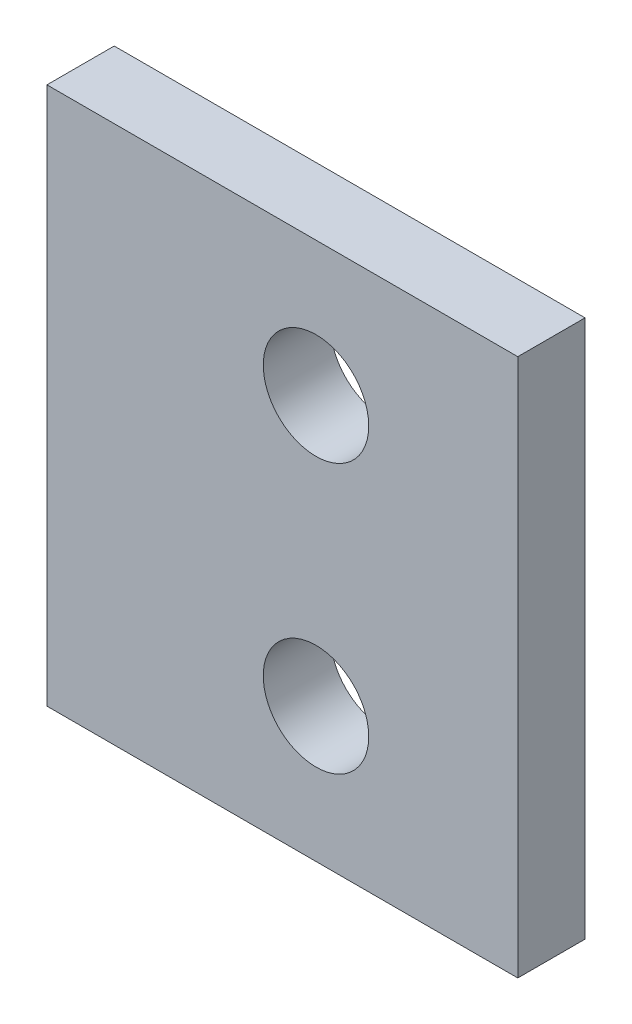
ISO-10303-21;
HEADER;
FILE_DESCRIPTION(('STEP AP214'),'2;1');
FILE_NAME('part.step','',(''),(''),'','','');
FILE_SCHEMA(('AUTOMOTIVE_DESIGN { 1 0 10303 214 1 1 1 1 }'));
ENDSEC;
DATA;
#1=APPLICATION_CONTEXT('core data for automotive mechanical design processes');
#2=APPLICATION_PROTOCOL_DEFINITION('international standard','automotive_design',2000,#1);
#3=PRODUCT_CONTEXT('',#1,'mechanical');
#4=PRODUCT('Part','Part','',(#3));
#5=PRODUCT_RELATED_PRODUCT_CATEGORY('part','',(#4));
#6=PRODUCT_DEFINITION_FORMATION('','',#4);
#7=PRODUCT_DEFINITION_CONTEXT('part definition',#1,'design');
#8=PRODUCT_DEFINITION('design','',#6,#7);
#9=PRODUCT_DEFINITION_SHAPE('','',#8);
#10=(LENGTH_UNIT() NAMED_UNIT(*) SI_UNIT(.MILLI.,.METRE.));
#11=(NAMED_UNIT(*) PLANE_ANGLE_UNIT() SI_UNIT($,.RADIAN.));
#12=(NAMED_UNIT(*) SI_UNIT($,.STERADIAN.) SOLID_ANGLE_UNIT());
#13=UNCERTAINTY_MEASURE_WITH_UNIT(LENGTH_MEASURE(1.E-05),#10,'distance_accuracy_value','');
#14=(GEOMETRIC_REPRESENTATION_CONTEXT(3) GLOBAL_UNCERTAINTY_ASSIGNED_CONTEXT((#13)) GLOBAL_UNIT_ASSIGNED_CONTEXT((#10,
#11,#12)) REPRESENTATION_CONTEXT('',''));
#15=CARTESIAN_POINT('',(0.,0.,0.));
#16=DIRECTION('',(0.,0.,1.));
#17=DIRECTION('',(1.,0.,0.));
#18=AXIS2_PLACEMENT_3D('',#15,#16,#17);
#19=CARTESIAN_POINT('',(0.,0.,3.175));
#20=DIRECTION('',(0.,0.,-1.));
#21=DIRECTION('',(-1.,0.,0.));
#22=AXIS2_PLACEMENT_3D('',#19,#20,#21);
#23=PLANE('',#22);
#24=DIRECTION('',(0.,1.,0.));
#25=VECTOR('',#24,1.);
#26=CARTESIAN_POINT('',(-3.175,101.6,3.175));
#27=LINE('',#26,#25);
#28=CARTESIAN_POINT('',(-3.175,76.2,3.175));
#29=VERTEX_POINT('',#28);
#30=CARTESIAN_POINT('',(-3.175,101.6,3.175));
#31=VERTEX_POINT('',#30);
#32=EDGE_CURVE('E86',#29,#31,#27,.T.);
#33=ORIENTED_EDGE('',*,*,#32,.T.);
#34=DIRECTION('',(-1.,0.,0.));
#35=VECTOR('',#34,1.);
#36=CARTESIAN_POINT('',(-3.175,101.6,3.175));
#37=LINE('',#36,#35);
#38=CARTESIAN_POINT('',(-25.4,101.6,3.175));
#39=VERTEX_POINT('',#38);
#40=EDGE_CURVE('E81',#31,#39,#37,.T.);
#41=ORIENTED_EDGE('',*,*,#40,.T.);
#42=DIRECTION('',(0.,-1.,0.));
#43=VECTOR('',#42,1.);
#44=CARTESIAN_POINT('',(-25.4,101.6,3.175));
#45=LINE('',#44,#43);
#46=CARTESIAN_POINT('',(-25.4,76.2,3.175));
#47=VERTEX_POINT('',#46);
#48=EDGE_CURVE('E84',#39,#47,#45,.T.);
#49=ORIENTED_EDGE('',*,*,#48,.T.);
#50=DIRECTION('',(1.,0.,0.));
#51=VECTOR('',#50,1.);
#52=CARTESIAN_POINT('',(-3.175,76.2,3.175));
#53=LINE('',#52,#51);
#54=EDGE_CURVE('E51',#47,#29,#53,.T.);
#55=ORIENTED_EDGE('',*,*,#54,.T.);
#56=EDGE_LOOP('',(#33,#41,#49,#55));
#57=FACE_BOUND('',#56,.T.);
#58=CARTESIAN_POINT('',(-12.7,82.55,3.175));
#59=DIRECTION('',(0.,0.,1.));
#60=DIRECTION('',(1.,0.,0.));
#61=AXIS2_PLACEMENT_3D('',#58,#59,#60);
#62=CIRCLE('',#61,2.4892);
#63=CARTESIAN_POINT('',(-10.2108,82.55,3.175));
#64=VERTEX_POINT('',#63);
#65=EDGE_CURVE('E101',#64,#64,#62,.T.);
#66=ORIENTED_EDGE('',*,*,#65,.F.);
#67=EDGE_LOOP('',(#66));
#68=FACE_BOUND('',#67,.T.);
#69=CARTESIAN_POINT('',(-12.7,95.25,3.175));
#70=DIRECTION('',(0.,0.,1.));
#71=DIRECTION('',(1.,0.,0.));
#72=AXIS2_PLACEMENT_3D('',#69,#70,#71);
#73=CIRCLE('',#72,2.4892);
#74=CARTESIAN_POINT('',(-10.2108,95.25,3.175));
#75=VERTEX_POINT('',#74);
#76=EDGE_CURVE('E116',#75,#75,#73,.T.);
#77=ORIENTED_EDGE('',*,*,#76,.F.);
#78=EDGE_LOOP('',(#77));
#79=FACE_BOUND('',#78,.T.);
#80=ADVANCED_FACE('F34',(#57,#68,#79),#23,.F.);
#81=CARTESIAN_POINT('',(0.,0.,0.));
#82=DIRECTION('',(0.,0.,-1.));
#83=DIRECTION('',(-1.,0.,0.));
#84=AXIS2_PLACEMENT_3D('',#81,#82,#83);
#85=PLANE('',#84);
#86=CARTESIAN_POINT('',(-12.7,82.55,0.));
#87=DIRECTION('',(0.,0.,1.));
#88=DIRECTION('',(1.,0.,0.));
#89=AXIS2_PLACEMENT_3D('',#86,#87,#88);
#90=CIRCLE('',#89,2.4892);
#91=CARTESIAN_POINT('',(-10.2108,82.55,0.));
#92=VERTEX_POINT('',#91);
#93=EDGE_CURVE('E113',#92,#92,#90,.T.);
#94=ORIENTED_EDGE('',*,*,#93,.T.);
#95=EDGE_LOOP('',(#94));
#96=FACE_BOUND('',#95,.T.);
#97=DIRECTION('',(0.,1.,0.));
#98=VECTOR('',#97,1.);
#99=CARTESIAN_POINT('',(-3.175,101.6,0.));
#100=LINE('',#99,#98);
#101=CARTESIAN_POINT('',(-3.175,76.2,0.));
#102=VERTEX_POINT('',#101);
#103=CARTESIAN_POINT('',(-3.175,101.6,0.));
#104=VERTEX_POINT('',#103);
#105=EDGE_CURVE('E98',#102,#104,#100,.T.);
#106=ORIENTED_EDGE('',*,*,#105,.F.);
#107=DIRECTION('',(1.,0.,0.));
#108=VECTOR('',#107,1.);
#109=CARTESIAN_POINT('',(-3.175,76.2,0.));
#110=LINE('',#109,#108);
#111=CARTESIAN_POINT('',(-25.4,76.2,0.));
#112=VERTEX_POINT('',#111);
#113=EDGE_CURVE('E74',#112,#102,#110,.T.);
#114=ORIENTED_EDGE('',*,*,#113,.F.);
#115=DIRECTION('',(0.,-1.,0.));
#116=VECTOR('',#115,1.);
#117=CARTESIAN_POINT('',(-25.4,101.6,0.));
#118=LINE('',#117,#116);
#119=CARTESIAN_POINT('',(-25.4,101.6,0.));
#120=VERTEX_POINT('',#119);
#121=EDGE_CURVE('E68',#120,#112,#118,.T.);
#122=ORIENTED_EDGE('',*,*,#121,.F.);
#123=DIRECTION('',(-1.,0.,0.));
#124=VECTOR('',#123,1.);
#125=CARTESIAN_POINT('',(-3.175,101.6,0.));
#126=LINE('',#125,#124);
#127=EDGE_CURVE('E90',#104,#120,#126,.T.);
#128=ORIENTED_EDGE('',*,*,#127,.F.);
#129=EDGE_LOOP('',(#106,#114,#122,#128));
#130=FACE_BOUND('',#129,.T.);
#131=CARTESIAN_POINT('',(-12.7,95.25,0.));
#132=DIRECTION('',(0.,0.,1.));
#133=DIRECTION('',(1.,0.,0.));
#134=AXIS2_PLACEMENT_3D('',#131,#132,#133);
#135=CIRCLE('',#134,2.4892);
#136=CARTESIAN_POINT('',(-10.2108,95.25,0.));
#137=VERTEX_POINT('',#136);
#138=EDGE_CURVE('E119',#137,#137,#135,.T.);
#139=ORIENTED_EDGE('',*,*,#138,.T.);
#140=EDGE_LOOP('',(#139));
#141=FACE_BOUND('',#140,.T.);
#142=ADVANCED_FACE('F109',(#96,#130,#141),#85,.T.);
#143=CARTESIAN_POINT('',(-3.175,101.6,3.175));
#144=DIRECTION('',(-1.,0.,0.));
#145=DIRECTION('',(0.,-1.,0.));
#146=AXIS2_PLACEMENT_3D('',#143,#144,#145);
#147=PLANE('',#146);
#148=ORIENTED_EDGE('',*,*,#105,.T.);
#149=DIRECTION('',(0.,0.,-1.));
#150=VECTOR('',#149,1.);
#151=CARTESIAN_POINT('',(-3.175,101.6,3.175));
#152=LINE('',#151,#150);
#153=EDGE_CURVE('E11',#31,#104,#152,.T.);
#154=ORIENTED_EDGE('',*,*,#153,.F.);
#155=ORIENTED_EDGE('',*,*,#32,.F.);
#156=DIRECTION('',(0.,0.,-1.));
#157=VECTOR('',#156,1.);
#158=CARTESIAN_POINT('',(-3.175,76.2,3.175));
#159=LINE('',#158,#157);
#160=EDGE_CURVE('E94',#29,#102,#159,.T.);
#161=ORIENTED_EDGE('',*,*,#160,.T.);
#162=EDGE_LOOP('',(#148,#154,#155,#161));
#163=FACE_BOUND('',#162,.T.);
#164=ADVANCED_FACE('F36',(#163),#147,.F.);
#165=CARTESIAN_POINT('',(-3.175,101.6,3.175));
#166=DIRECTION('',(0.,-1.,0.));
#167=DIRECTION('',(0.,0.,-1.));
#168=AXIS2_PLACEMENT_3D('',#165,#166,#167);
#169=PLANE('',#168);
#170=ORIENTED_EDGE('',*,*,#127,.T.);
#171=DIRECTION('',(0.,0.,-1.));
#172=VECTOR('',#171,1.);
#173=CARTESIAN_POINT('',(-25.4,101.6,3.175));
#174=LINE('',#173,#172);
#175=EDGE_CURVE('E43',#39,#120,#174,.T.);
#176=ORIENTED_EDGE('',*,*,#175,.F.);
#177=ORIENTED_EDGE('',*,*,#40,.F.);
#178=ORIENTED_EDGE('',*,*,#153,.T.);
#179=EDGE_LOOP('',(#170,#176,#177,#178));
#180=FACE_BOUND('',#179,.T.);
#181=ADVANCED_FACE('F89',(#180),#169,.F.);
#182=CARTESIAN_POINT('',(-25.4,101.6,3.175));
#183=DIRECTION('',(1.,0.,0.));
#184=DIRECTION('',(0.,0.,-1.));
#185=AXIS2_PLACEMENT_3D('',#182,#183,#184);
#186=PLANE('',#185);
#187=ORIENTED_EDGE('',*,*,#121,.T.);
#188=DIRECTION('',(0.,0.,-1.));
#189=VECTOR('',#188,1.);
#190=CARTESIAN_POINT('',(-25.4,76.2,3.175));
#191=LINE('',#190,#189);
#192=EDGE_CURVE('E91',#47,#112,#191,.T.);
#193=ORIENTED_EDGE('',*,*,#192,.F.);
#194=ORIENTED_EDGE('',*,*,#48,.F.);
#195=ORIENTED_EDGE('',*,*,#175,.T.);
#196=EDGE_LOOP('',(#187,#193,#194,#195));
#197=FACE_BOUND('',#196,.T.);
#198=ADVANCED_FACE('F92',(#197),#186,.F.);
#199=CARTESIAN_POINT('',(-3.175,76.2,3.175));
#200=DIRECTION('',(0.,1.,0.));
#201=DIRECTION('',(0.,0.,1.));
#202=AXIS2_PLACEMENT_3D('',#199,#200,#201);
#203=PLANE('',#202);
#204=ORIENTED_EDGE('',*,*,#113,.T.);
#205=ORIENTED_EDGE('',*,*,#160,.F.);
#206=ORIENTED_EDGE('',*,*,#54,.F.);
#207=ORIENTED_EDGE('',*,*,#192,.T.);
#208=EDGE_LOOP('',(#204,#205,#206,#207));
#209=FACE_BOUND('',#208,.T.);
#210=ADVANCED_FACE('F106',(#209),#203,.F.);
#211=CARTESIAN_POINT('',(-12.7,82.55,3.175));
#212=DIRECTION('',(0.,0.,-1.));
#213=DIRECTION('',(-1.,0.,0.));
#214=AXIS2_PLACEMENT_3D('',#211,#212,#213);
#215=CYLINDRICAL_SURFACE('',#214,2.4892);
#216=ORIENTED_EDGE('',*,*,#65,.T.);
#217=EDGE_LOOP('',(#216));
#218=FACE_BOUND('',#217,.T.);
#219=ORIENTED_EDGE('',*,*,#93,.F.);
#220=EDGE_LOOP('',(#219));
#221=FACE_BOUND('',#220,.T.);
#222=ADVANCED_FACE('F136',(#218,#221),#215,.F.);
#223=CARTESIAN_POINT('',(-12.7,95.25,3.175));
#224=DIRECTION('',(0.,0.,-1.));
#225=DIRECTION('',(-1.,0.,0.));
#226=AXIS2_PLACEMENT_3D('',#223,#224,#225);
#227=CYLINDRICAL_SURFACE('',#226,2.4892);
#228=ORIENTED_EDGE('',*,*,#76,.T.);
#229=EDGE_LOOP('',(#228));
#230=FACE_BOUND('',#229,.T.);
#231=ORIENTED_EDGE('',*,*,#138,.F.);
#232=EDGE_LOOP('',(#231));
#233=FACE_BOUND('',#232,.T.);
#234=ADVANCED_FACE('F125',(#230,#233),#227,.F.);
#235=CLOSED_SHELL('',(#80,#142,#164,#181,#198,#210,#222,#234));
#236=MANIFOLD_SOLID_BREP('B2',#235);
#237=ADVANCED_BREP_SHAPE_REPRESENTATION('',(#18,#236),#14);
#238=SHAPE_DEFINITION_REPRESENTATION(#9,#237);
ENDSEC;
END-ISO-10303-21;
